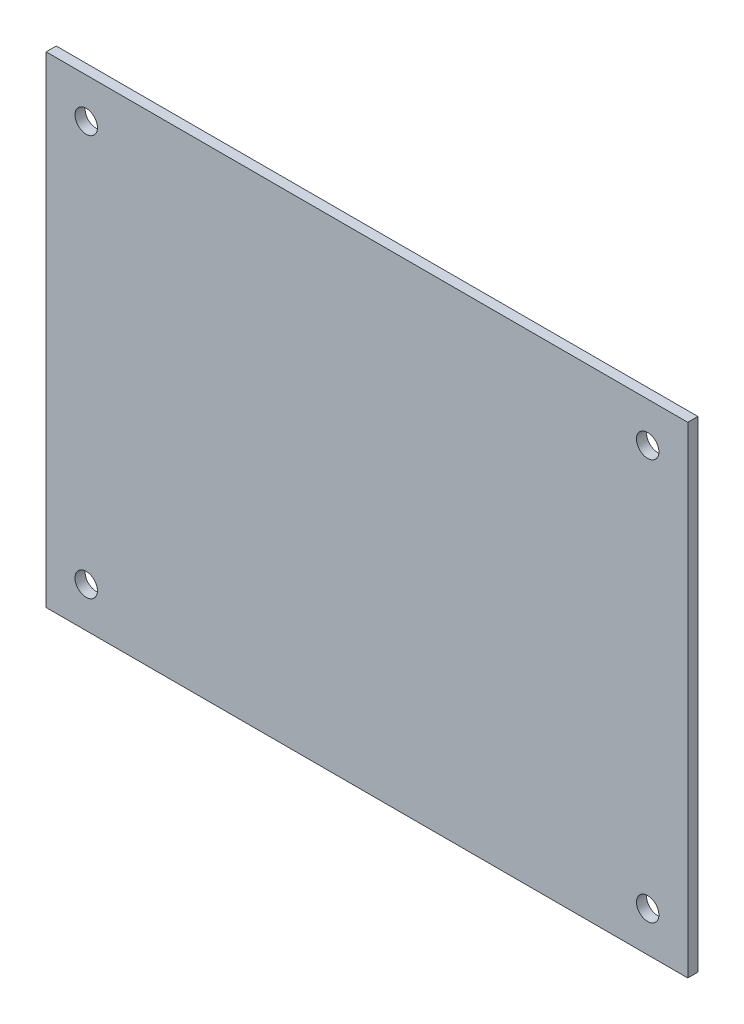
ISO-10303-21;
HEADER;
FILE_DESCRIPTION(('STEP AP214'),'2;1');
FILE_NAME('part.step','',(''),(''),'','','');
FILE_SCHEMA(('AUTOMOTIVE_DESIGN { 1 0 10303 214 1 1 1 1 }'));
ENDSEC;
DATA;
#1=APPLICATION_CONTEXT('core data for automotive mechanical design processes');
#2=APPLICATION_PROTOCOL_DEFINITION('international standard','automotive_design',2000,#1);
#3=PRODUCT_CONTEXT('',#1,'mechanical');
#4=PRODUCT('Part','Part','',(#3));
#5=PRODUCT_RELATED_PRODUCT_CATEGORY('part','',(#4));
#6=PRODUCT_DEFINITION_FORMATION('','',#4);
#7=PRODUCT_DEFINITION_CONTEXT('part definition',#1,'design');
#8=PRODUCT_DEFINITION('design','',#6,#7);
#9=PRODUCT_DEFINITION_SHAPE('','',#8);
#10=(LENGTH_UNIT() NAMED_UNIT(*) SI_UNIT(.MILLI.,.METRE.));
#11=(NAMED_UNIT(*) PLANE_ANGLE_UNIT() SI_UNIT($,.RADIAN.));
#12=(NAMED_UNIT(*) SI_UNIT($,.STERADIAN.) SOLID_ANGLE_UNIT());
#13=UNCERTAINTY_MEASURE_WITH_UNIT(LENGTH_MEASURE(1.E-05),#10,'distance_accuracy_value','');
#14=(GEOMETRIC_REPRESENTATION_CONTEXT(3) GLOBAL_UNCERTAINTY_ASSIGNED_CONTEXT((#13)) GLOBAL_UNIT_ASSIGNED_CONTEXT((#10,
#11,#12)) REPRESENTATION_CONTEXT('',''));
#15=CARTESIAN_POINT('',(0.,0.,0.));
#16=DIRECTION('',(0.,0.,1.));
#17=DIRECTION('',(1.,0.,0.));
#18=AXIS2_PLACEMENT_3D('',#15,#16,#17);
#19=CARTESIAN_POINT('',(0.,0.,1.6002));
#20=DIRECTION('',(1.,0.,0.));
#21=DIRECTION('',(0.,1.,0.));
#22=AXIS2_PLACEMENT_3D('',#19,#20,#21);
#23=PLANE('',#22);
#24=DIRECTION('',(0.,-1.,0.));
#25=VECTOR('',#24,1.);
#26=CARTESIAN_POINT('',(0.,0.,0.));
#27=LINE('',#26,#25);
#28=CARTESIAN_POINT('',(0.,0.,0.));
#29=VERTEX_POINT('',#28);
#30=CARTESIAN_POINT('',(0.,-76.2,0.));
#31=VERTEX_POINT('',#30);
#32=EDGE_CURVE('E71',#29,#31,#27,.T.);
#33=ORIENTED_EDGE('',*,*,#32,.T.);
#34=DIRECTION('',(0.,0.,-1.));
#35=VECTOR('',#34,1.);
#36=CARTESIAN_POINT('',(0.,-76.2,1.6002));
#37=LINE('',#36,#35);
#38=CARTESIAN_POINT('',(0.,-76.2,1.6002));
#39=VERTEX_POINT('',#38);
#40=EDGE_CURVE('E78',#39,#31,#37,.T.);
#41=ORIENTED_EDGE('',*,*,#40,.F.);
#42=DIRECTION('',(0.,-1.,0.));
#43=VECTOR('',#42,1.);
#44=CARTESIAN_POINT('',(0.,0.,1.6002));
#45=LINE('',#44,#43);
#46=CARTESIAN_POINT('',(0.,0.,1.6002));
#47=VERTEX_POINT('',#46);
#48=EDGE_CURVE('E98',#47,#39,#45,.T.);
#49=ORIENTED_EDGE('',*,*,#48,.F.);
#50=DIRECTION('',(0.,0.,-1.));
#51=VECTOR('',#50,1.);
#52=CARTESIAN_POINT('',(0.,0.,1.6002));
#53=LINE('',#52,#51);
#54=EDGE_CURVE('E87',#47,#29,#53,.T.);
#55=ORIENTED_EDGE('',*,*,#54,.T.);
#56=EDGE_LOOP('',(#33,#41,#49,#55));
#57=FACE_BOUND('',#56,.T.);
#58=ADVANCED_FACE('F24',(#57),#23,.F.);
#59=CARTESIAN_POINT('',(0.,-76.2,1.6002));
#60=DIRECTION('',(0.,1.,0.));
#61=DIRECTION('',(0.,0.,1.));
#62=AXIS2_PLACEMENT_3D('',#59,#60,#61);
#63=PLANE('',#62);
#64=DIRECTION('',(1.,0.,0.));
#65=VECTOR('',#64,1.);
#66=CARTESIAN_POINT('',(0.,-76.2,0.));
#67=LINE('',#66,#65);
#68=CARTESIAN_POINT('',(101.6,-76.2,0.));
#69=VERTEX_POINT('',#68);
#70=EDGE_CURVE('E65',#31,#69,#67,.T.);
#71=ORIENTED_EDGE('',*,*,#70,.T.);
#72=DIRECTION('',(0.,0.,-1.));
#73=VECTOR('',#72,1.);
#74=CARTESIAN_POINT('',(101.6,-76.2,1.6002));
#75=LINE('',#74,#73);
#76=CARTESIAN_POINT('',(101.6,-76.2,1.6002));
#77=VERTEX_POINT('',#76);
#78=EDGE_CURVE('E84',#77,#69,#75,.T.);
#79=ORIENTED_EDGE('',*,*,#78,.F.);
#80=DIRECTION('',(1.,0.,0.));
#81=VECTOR('',#80,1.);
#82=CARTESIAN_POINT('',(0.,-76.2,1.6002));
#83=LINE('',#82,#81);
#84=EDGE_CURVE('E80',#39,#77,#83,.T.);
#85=ORIENTED_EDGE('',*,*,#84,.F.);
#86=ORIENTED_EDGE('',*,*,#40,.T.);
#87=EDGE_LOOP('',(#71,#79,#85,#86));
#88=FACE_BOUND('',#87,.T.);
#89=ADVANCED_FACE('F79',(#88),#63,.F.);
#90=CARTESIAN_POINT('',(101.6,0.,1.6002));
#91=DIRECTION('',(-1.,0.,0.));
#92=DIRECTION('',(0.,-1.,0.));
#93=AXIS2_PLACEMENT_3D('',#90,#91,#92);
#94=PLANE('',#93);
#95=DIRECTION('',(0.,1.,0.));
#96=VECTOR('',#95,1.);
#97=CARTESIAN_POINT('',(101.6,0.,0.));
#98=LINE('',#97,#96);
#99=CARTESIAN_POINT('',(101.6,0.,0.));
#100=VERTEX_POINT('',#99);
#101=EDGE_CURVE('E72',#69,#100,#98,.T.);
#102=ORIENTED_EDGE('',*,*,#101,.T.);
#103=DIRECTION('',(0.,0.,-1.));
#104=VECTOR('',#103,1.);
#105=CARTESIAN_POINT('',(101.6,0.,1.6002));
#106=LINE('',#105,#104);
#107=CARTESIAN_POINT('',(101.6,0.,1.6002));
#108=VERTEX_POINT('',#107);
#109=EDGE_CURVE('E104',#108,#100,#106,.T.);
#110=ORIENTED_EDGE('',*,*,#109,.F.);
#111=DIRECTION('',(0.,1.,0.));
#112=VECTOR('',#111,1.);
#113=CARTESIAN_POINT('',(101.6,0.,1.6002));
#114=LINE('',#113,#112);
#115=EDGE_CURVE('E44',#77,#108,#114,.T.);
#116=ORIENTED_EDGE('',*,*,#115,.F.);
#117=ORIENTED_EDGE('',*,*,#78,.T.);
#118=EDGE_LOOP('',(#102,#110,#116,#117));
#119=FACE_BOUND('',#118,.T.);
#120=ADVANCED_FACE('F134',(#119),#94,.F.);
#121=CARTESIAN_POINT('',(0.,0.,1.6002));
#122=DIRECTION('',(0.,-1.,0.));
#123=DIRECTION('',(0.,0.,-1.));
#124=AXIS2_PLACEMENT_3D('',#121,#122,#123);
#125=PLANE('',#124);
#126=DIRECTION('',(-1.,0.,0.));
#127=VECTOR('',#126,1.);
#128=CARTESIAN_POINT('',(0.,0.,0.));
#129=LINE('',#128,#127);
#130=EDGE_CURVE('E96',#100,#29,#129,.T.);
#131=ORIENTED_EDGE('',*,*,#130,.T.);
#132=ORIENTED_EDGE('',*,*,#54,.F.);
#133=DIRECTION('',(-1.,0.,0.));
#134=VECTOR('',#133,1.);
#135=CARTESIAN_POINT('',(0.,0.,1.6002));
#136=LINE('',#135,#134);
#137=EDGE_CURVE('E39',#108,#47,#136,.T.);
#138=ORIENTED_EDGE('',*,*,#137,.F.);
#139=ORIENTED_EDGE('',*,*,#109,.T.);
#140=EDGE_LOOP('',(#131,#132,#138,#139));
#141=FACE_BOUND('',#140,.T.);
#142=ADVANCED_FACE('F123',(#141),#125,.F.);
#143=CARTESIAN_POINT('',(0.,-76.2,1.6002));
#144=DIRECTION('',(0.,0.,1.));
#145=DIRECTION('',(1.,0.,0.));
#146=AXIS2_PLACEMENT_3D('',#143,#144,#145);
#147=PLANE('',#146);
#148=CARTESIAN_POINT('',(6.34999999999999,-6.35000000000002,1.6002));
#149=DIRECTION('',(0.,0.,1.));
#150=DIRECTION('',(1.,0.,0.));
#151=AXIS2_PLACEMENT_3D('',#148,#149,#150);
#152=CIRCLE('',#151,1.778);
#153=CARTESIAN_POINT('',(8.12799999999999,-6.35000000000002,1.6002));
#154=VERTEX_POINT('',#153);
#155=EDGE_CURVE('E167',#154,#154,#152,.T.);
#156=ORIENTED_EDGE('',*,*,#155,.F.);
#157=EDGE_LOOP('',(#156));
#158=FACE_BOUND('',#157,.T.);
#159=CARTESIAN_POINT('',(6.35,-69.85,1.6002));
#160=DIRECTION('',(0.,0.,1.));
#161=DIRECTION('',(1.,0.,0.));
#162=AXIS2_PLACEMENT_3D('',#159,#160,#161);
#163=CIRCLE('',#162,1.778);
#164=CARTESIAN_POINT('',(8.12799999999999,-69.85,1.6002));
#165=VERTEX_POINT('',#164);
#166=EDGE_CURVE('E91',#165,#165,#163,.T.);
#167=ORIENTED_EDGE('',*,*,#166,.F.);
#168=EDGE_LOOP('',(#167));
#169=FACE_BOUND('',#168,.T.);
#170=ORIENTED_EDGE('',*,*,#48,.T.);
#171=ORIENTED_EDGE('',*,*,#84,.T.);
#172=ORIENTED_EDGE('',*,*,#115,.T.);
#173=ORIENTED_EDGE('',*,*,#137,.T.);
#174=EDGE_LOOP('',(#170,#171,#172,#173));
#175=FACE_BOUND('',#174,.T.);
#176=CARTESIAN_POINT('',(95.25,-69.85,1.6002));
#177=DIRECTION('',(0.,0.,1.));
#178=DIRECTION('',(1.,0.,0.));
#179=AXIS2_PLACEMENT_3D('',#176,#177,#178);
#180=CIRCLE('',#179,1.778);
#181=CARTESIAN_POINT('',(97.028,-69.85,1.6002));
#182=VERTEX_POINT('',#181);
#183=EDGE_CURVE('E110',#182,#182,#180,.T.);
#184=ORIENTED_EDGE('',*,*,#183,.F.);
#185=EDGE_LOOP('',(#184));
#186=FACE_BOUND('',#185,.T.);
#187=CARTESIAN_POINT('',(95.25,-6.35000000000002,1.6002));
#188=DIRECTION('',(0.,0.,1.));
#189=DIRECTION('',(1.,0.,0.));
#190=AXIS2_PLACEMENT_3D('',#187,#188,#189);
#191=CIRCLE('',#190,1.778);
#192=CARTESIAN_POINT('',(97.028,-6.35000000000002,1.6002));
#193=VERTEX_POINT('',#192);
#194=EDGE_CURVE('E11',#193,#193,#191,.T.);
#195=ORIENTED_EDGE('',*,*,#194,.F.);
#196=EDGE_LOOP('',(#195));
#197=FACE_BOUND('',#196,.T.);
#198=ADVANCED_FACE('F121',(#158,#169,#175,#186,#197),#147,.T.);
#199=CARTESIAN_POINT('',(0.,-76.2,0.));
#200=DIRECTION('',(0.,0.,1.));
#201=DIRECTION('',(1.,0.,0.));
#202=AXIS2_PLACEMENT_3D('',#199,#200,#201);
#203=PLANE('',#202);
#204=CARTESIAN_POINT('',(6.34999999999999,-6.35000000000002,0.));
#205=DIRECTION('',(0.,0.,1.));
#206=DIRECTION('',(1.,0.,0.));
#207=AXIS2_PLACEMENT_3D('',#204,#205,#206);
#208=CIRCLE('',#207,1.778);
#209=CARTESIAN_POINT('',(8.12799999999999,-6.35000000000002,0.));
#210=VERTEX_POINT('',#209);
#211=EDGE_CURVE('E165',#210,#210,#208,.T.);
#212=ORIENTED_EDGE('',*,*,#211,.T.);
#213=EDGE_LOOP('',(#212));
#214=FACE_BOUND('',#213,.T.);
#215=CARTESIAN_POINT('',(6.35,-69.85,0.));
#216=DIRECTION('',(0.,0.,1.));
#217=DIRECTION('',(1.,0.,0.));
#218=AXIS2_PLACEMENT_3D('',#215,#216,#217);
#219=CIRCLE('',#218,1.778);
#220=CARTESIAN_POINT('',(8.12799999999999,-69.85,0.));
#221=VERTEX_POINT('',#220);
#222=EDGE_CURVE('E88',#221,#221,#219,.T.);
#223=ORIENTED_EDGE('',*,*,#222,.T.);
#224=EDGE_LOOP('',(#223));
#225=FACE_BOUND('',#224,.T.);
#226=ORIENTED_EDGE('',*,*,#32,.F.);
#227=ORIENTED_EDGE('',*,*,#130,.F.);
#228=ORIENTED_EDGE('',*,*,#101,.F.);
#229=ORIENTED_EDGE('',*,*,#70,.F.);
#230=EDGE_LOOP('',(#226,#227,#228,#229));
#231=FACE_BOUND('',#230,.T.);
#232=CARTESIAN_POINT('',(95.25,-69.85,0.));
#233=DIRECTION('',(0.,0.,1.));
#234=DIRECTION('',(1.,0.,0.));
#235=AXIS2_PLACEMENT_3D('',#232,#233,#234);
#236=CIRCLE('',#235,1.778);
#237=CARTESIAN_POINT('',(97.028,-69.85,0.));
#238=VERTEX_POINT('',#237);
#239=EDGE_CURVE('E83',#238,#238,#236,.T.);
#240=ORIENTED_EDGE('',*,*,#239,.T.);
#241=EDGE_LOOP('',(#240));
#242=FACE_BOUND('',#241,.T.);
#243=CARTESIAN_POINT('',(95.25,-6.35000000000002,0.));
#244=DIRECTION('',(0.,0.,1.));
#245=DIRECTION('',(1.,0.,0.));
#246=AXIS2_PLACEMENT_3D('',#243,#244,#245);
#247=CIRCLE('',#246,1.778);
#248=CARTESIAN_POINT('',(97.028,-6.35000000000002,0.));
#249=VERTEX_POINT('',#248);
#250=EDGE_CURVE('E32',#249,#249,#247,.T.);
#251=ORIENTED_EDGE('',*,*,#250,.T.);
#252=EDGE_LOOP('',(#251));
#253=FACE_BOUND('',#252,.T.);
#254=ADVANCED_FACE('F67',(#214,#225,#231,#242,#253),#203,.F.);
#255=CARTESIAN_POINT('',(6.35,-69.85,0.));
#256=DIRECTION('',(0.,0.,1.));
#257=DIRECTION('',(1.,0.,0.));
#258=AXIS2_PLACEMENT_3D('',#255,#256,#257);
#259=CYLINDRICAL_SURFACE('',#258,1.778);
#260=ORIENTED_EDGE('',*,*,#222,.F.);
#261=EDGE_LOOP('',(#260));
#262=FACE_BOUND('',#261,.T.);
#263=ORIENTED_EDGE('',*,*,#166,.T.);
#264=EDGE_LOOP('',(#263));
#265=FACE_BOUND('',#264,.T.);
#266=ADVANCED_FACE('F130',(#262,#265),#259,.F.);
#267=CARTESIAN_POINT('',(6.34999999999999,-6.35000000000002,0.));
#268=DIRECTION('',(0.,0.,1.));
#269=DIRECTION('',(1.,0.,0.));
#270=AXIS2_PLACEMENT_3D('',#267,#268,#269);
#271=CYLINDRICAL_SURFACE('',#270,1.778);
#272=ORIENTED_EDGE('',*,*,#211,.F.);
#273=EDGE_LOOP('',(#272));
#274=FACE_BOUND('',#273,.T.);
#275=ORIENTED_EDGE('',*,*,#155,.T.);
#276=EDGE_LOOP('',(#275));
#277=FACE_BOUND('',#276,.T.);
#278=ADVANCED_FACE('F147',(#274,#277),#271,.F.);
#279=CARTESIAN_POINT('',(95.25,-69.85,0.));
#280=DIRECTION('',(0.,0.,1.));
#281=DIRECTION('',(1.,0.,0.));
#282=AXIS2_PLACEMENT_3D('',#279,#280,#281);
#283=CYLINDRICAL_SURFACE('',#282,1.778);
#284=ORIENTED_EDGE('',*,*,#239,.F.);
#285=EDGE_LOOP('',(#284));
#286=FACE_BOUND('',#285,.T.);
#287=ORIENTED_EDGE('',*,*,#183,.T.);
#288=EDGE_LOOP('',(#287));
#289=FACE_BOUND('',#288,.T.);
#290=ADVANCED_FACE('F118',(#286,#289),#283,.F.);
#291=CARTESIAN_POINT('',(95.25,-6.35000000000002,0.));
#292=DIRECTION('',(0.,0.,1.));
#293=DIRECTION('',(1.,0.,0.));
#294=AXIS2_PLACEMENT_3D('',#291,#292,#293);
#295=CYLINDRICAL_SURFACE('',#294,1.778);
#296=ORIENTED_EDGE('',*,*,#250,.F.);
#297=EDGE_LOOP('',(#296));
#298=FACE_BOUND('',#297,.T.);
#299=ORIENTED_EDGE('',*,*,#194,.T.);
#300=EDGE_LOOP('',(#299));
#301=FACE_BOUND('',#300,.T.);
#302=ADVANCED_FACE('F26',(#298,#301),#295,.F.);
#303=CLOSED_SHELL('',(#58,#89,#120,#142,#198,#254,#266,#278,#290,#302));
#304=MANIFOLD_SOLID_BREP('B2',#303);
#305=ADVANCED_BREP_SHAPE_REPRESENTATION('',(#18,#304),#14);
#306=SHAPE_DEFINITION_REPRESENTATION(#9,#305);
ENDSEC;
END-ISO-10303-21;
